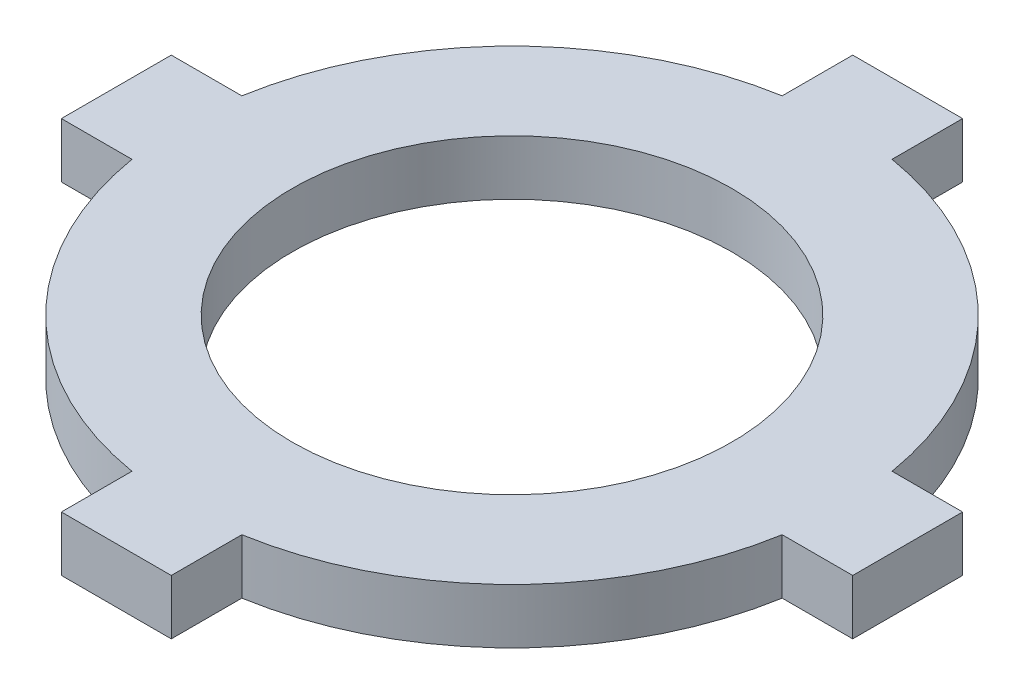
ISO-10303-21;
HEADER;
FILE_DESCRIPTION(('STEP AP214'),'2;1');
FILE_NAME('part.step','',(''),(''),'','','');
FILE_SCHEMA(('AUTOMOTIVE_DESIGN { 1 0 10303 214 1 1 1 1 }'));
ENDSEC;
DATA;
#1=APPLICATION_CONTEXT('core data for automotive mechanical design processes');
#2=APPLICATION_PROTOCOL_DEFINITION('international standard','automotive_design',2000,#1);
#3=PRODUCT_CONTEXT('',#1,'mechanical');
#4=PRODUCT('Part','Part','',(#3));
#5=PRODUCT_RELATED_PRODUCT_CATEGORY('part','',(#4));
#6=PRODUCT_DEFINITION_FORMATION('','',#4);
#7=PRODUCT_DEFINITION_CONTEXT('part definition',#1,'design');
#8=PRODUCT_DEFINITION('design','',#6,#7);
#9=PRODUCT_DEFINITION_SHAPE('','',#8);
#10=(LENGTH_UNIT() NAMED_UNIT(*) SI_UNIT(.MILLI.,.METRE.));
#11=(NAMED_UNIT(*) PLANE_ANGLE_UNIT() SI_UNIT($,.RADIAN.));
#12=(NAMED_UNIT(*) SI_UNIT($,.STERADIAN.) SOLID_ANGLE_UNIT());
#13=UNCERTAINTY_MEASURE_WITH_UNIT(LENGTH_MEASURE(1.E-05),#10,'distance_accuracy_value','');
#14=(GEOMETRIC_REPRESENTATION_CONTEXT(3) GLOBAL_UNCERTAINTY_ASSIGNED_CONTEXT((#13)) GLOBAL_UNIT_ASSIGNED_CONTEXT((#10,
#11,#12)) REPRESENTATION_CONTEXT('',''));
#15=CARTESIAN_POINT('',(0.,0.,0.));
#16=DIRECTION('',(0.,0.,1.));
#17=DIRECTION('',(1.,0.,0.));
#18=AXIS2_PLACEMENT_3D('',#15,#16,#17);
#19=CARTESIAN_POINT('',(0.,3.175,0.));
#20=DIRECTION('',(0.,1.,0.));
#21=DIRECTION('',(0.,0.,1.));
#22=AXIS2_PLACEMENT_3D('',#19,#20,#21);
#23=PLANE('',#22);
#24=CARTESIAN_POINT('',(0.,3.175,0.));
#25=DIRECTION('',(0.,1.,0.));
#26=DIRECTION('',(0.,0.,1.));
#27=AXIS2_PLACEMENT_3D('',#24,#25,#26);
#28=CIRCLE('',#27,19.05);
#29=CARTESIAN_POINT('',(-3.175,3.175,-18.7835533113413));
#30=VERTEX_POINT('',#29);
#31=CARTESIAN_POINT('',(-18.7835533113413,3.175,-3.175));
#32=VERTEX_POINT('',#31);
#33=EDGE_CURVE('E211',#30,#32,#28,.T.);
#34=ORIENTED_EDGE('',*,*,#33,.T.);
#35=DIRECTION('',(-1.,0.,0.));
#36=VECTOR('',#35,1.);
#37=CARTESIAN_POINT('',(-18.7835533113413,3.175,-3.175));
#38=LINE('',#37,#36);
#39=CARTESIAN_POINT('',(-22.86,3.175,-3.175));
#40=VERTEX_POINT('',#39);
#41=EDGE_CURVE('E119',#32,#40,#38,.T.);
#42=ORIENTED_EDGE('',*,*,#41,.T.);
#43=DIRECTION('',(0.,0.,1.));
#44=VECTOR('',#43,1.);
#45=CARTESIAN_POINT('',(-22.86,3.175,3.175));
#46=LINE('',#45,#44);
#47=CARTESIAN_POINT('',(-22.86,3.175,3.175));
#48=VERTEX_POINT('',#47);
#49=EDGE_CURVE('E250',#40,#48,#46,.T.);
#50=ORIENTED_EDGE('',*,*,#49,.T.);
#51=DIRECTION('',(1.,0.,0.));
#52=VECTOR('',#51,1.);
#53=CARTESIAN_POINT('',(-18.7835533113413,3.175,3.175));
#54=LINE('',#53,#52);
#55=CARTESIAN_POINT('',(-18.7835533113413,3.175,3.175));
#56=VERTEX_POINT('',#55);
#57=EDGE_CURVE('E269',#48,#56,#54,.T.);
#58=ORIENTED_EDGE('',*,*,#57,.T.);
#59=CARTESIAN_POINT('',(0.,3.175,0.));
#60=DIRECTION('',(0.,1.,0.));
#61=DIRECTION('',(0.,0.,1.));
#62=AXIS2_PLACEMENT_3D('',#59,#60,#61);
#63=CIRCLE('',#62,19.05);
#64=CARTESIAN_POINT('',(-3.175,3.175,18.7835533113413));
#65=VERTEX_POINT('',#64);
#66=EDGE_CURVE('E266',#56,#65,#63,.T.);
#67=ORIENTED_EDGE('',*,*,#66,.T.);
#68=DIRECTION('',(0.,0.,1.));
#69=VECTOR('',#68,1.);
#70=CARTESIAN_POINT('',(-3.175,3.175,22.86));
#71=LINE('',#70,#69);
#72=CARTESIAN_POINT('',(-3.175,3.175,22.86));
#73=VERTEX_POINT('',#72);
#74=EDGE_CURVE('E268',#65,#73,#71,.T.);
#75=ORIENTED_EDGE('',*,*,#74,.T.);
#76=DIRECTION('',(1.,0.,0.));
#77=VECTOR('',#76,1.);
#78=CARTESIAN_POINT('',(3.175,3.175,22.86));
#79=LINE('',#78,#77);
#80=CARTESIAN_POINT('',(3.175,3.175,22.86));
#81=VERTEX_POINT('',#80);
#82=EDGE_CURVE('E271',#73,#81,#79,.T.);
#83=ORIENTED_EDGE('',*,*,#82,.T.);
#84=DIRECTION('',(0.,0.,-1.));
#85=VECTOR('',#84,1.);
#86=CARTESIAN_POINT('',(3.175,3.175,22.86));
#87=LINE('',#86,#85);
#88=CARTESIAN_POINT('',(3.175,3.175,18.7835533113413));
#89=VERTEX_POINT('',#88);
#90=EDGE_CURVE('E277',#81,#89,#87,.T.);
#91=ORIENTED_EDGE('',*,*,#90,.T.);
#92=CARTESIAN_POINT('',(0.,3.175,0.));
#93=DIRECTION('',(0.,1.,0.));
#94=DIRECTION('',(0.,0.,1.));
#95=AXIS2_PLACEMENT_3D('',#92,#93,#94);
#96=CIRCLE('',#95,19.05);
#97=CARTESIAN_POINT('',(18.7835533113413,3.175,3.175));
#98=VERTEX_POINT('',#97);
#99=EDGE_CURVE('E279',#89,#98,#96,.T.);
#100=ORIENTED_EDGE('',*,*,#99,.T.);
#101=DIRECTION('',(1.,0.,0.));
#102=VECTOR('',#101,1.);
#103=CARTESIAN_POINT('',(22.86,3.175,3.175));
#104=LINE('',#103,#102);
#105=CARTESIAN_POINT('',(22.86,3.175,3.175));
#106=VERTEX_POINT('',#105);
#107=EDGE_CURVE('E281',#98,#106,#104,.T.);
#108=ORIENTED_EDGE('',*,*,#107,.T.);
#109=DIRECTION('',(0.,0.,-1.));
#110=VECTOR('',#109,1.);
#111=CARTESIAN_POINT('',(22.86,3.175,3.175));
#112=LINE('',#111,#110);
#113=CARTESIAN_POINT('',(22.86,3.175,-3.175));
#114=VERTEX_POINT('',#113);
#115=EDGE_CURVE('E283',#106,#114,#112,.T.);
#116=ORIENTED_EDGE('',*,*,#115,.T.);
#117=DIRECTION('',(-1.,0.,0.));
#118=VECTOR('',#117,1.);
#119=CARTESIAN_POINT('',(22.86,3.175,-3.175));
#120=LINE('',#119,#118);
#121=CARTESIAN_POINT('',(18.7835533113413,3.175,-3.175));
#122=VERTEX_POINT('',#121);
#123=EDGE_CURVE('E285',#114,#122,#120,.T.);
#124=ORIENTED_EDGE('',*,*,#123,.T.);
#125=CARTESIAN_POINT('',(0.,3.175,0.));
#126=DIRECTION('',(0.,1.,0.));
#127=DIRECTION('',(0.,0.,1.));
#128=AXIS2_PLACEMENT_3D('',#125,#126,#127);
#129=CIRCLE('',#128,19.05);
#130=CARTESIAN_POINT('',(3.175,3.175,-18.7835533113413));
#131=VERTEX_POINT('',#130);
#132=EDGE_CURVE('E162',#122,#131,#129,.T.);
#133=ORIENTED_EDGE('',*,*,#132,.T.);
#134=DIRECTION('',(0.,0.,-1.));
#135=VECTOR('',#134,1.);
#136=CARTESIAN_POINT('',(3.175,3.175,-18.7835533113413));
#137=LINE('',#136,#135);
#138=CARTESIAN_POINT('',(3.175,3.175,-22.86));
#139=VERTEX_POINT('',#138);
#140=EDGE_CURVE('E156',#131,#139,#137,.T.);
#141=ORIENTED_EDGE('',*,*,#140,.T.);
#142=DIRECTION('',(-1.,0.,0.));
#143=VECTOR('',#142,1.);
#144=CARTESIAN_POINT('',(3.175,3.175,-22.86));
#145=LINE('',#144,#143);
#146=CARTESIAN_POINT('',(-3.175,3.175,-22.86));
#147=VERTEX_POINT('',#146);
#148=EDGE_CURVE('E160',#139,#147,#145,.T.);
#149=ORIENTED_EDGE('',*,*,#148,.T.);
#150=DIRECTION('',(0.,0.,1.));
#151=VECTOR('',#150,1.);
#152=CARTESIAN_POINT('',(-3.175,3.175,-18.7835533113413));
#153=LINE('',#152,#151);
#154=EDGE_CURVE('E52',#147,#30,#153,.T.);
#155=ORIENTED_EDGE('',*,*,#154,.T.);
#156=EDGE_LOOP('',(#34,#42,#50,#58,#67,#75,#83,#91,#100,#108,#116,#124,#133,#141,#149,#155));
#157=FACE_BOUND('',#156,.T.);
#158=CARTESIAN_POINT('',(0.,3.175,0.));
#159=DIRECTION('',(0.,1.,0.));
#160=DIRECTION('',(0.,0.,1.));
#161=AXIS2_PLACEMENT_3D('',#158,#159,#160);
#162=CIRCLE('',#161,12.7);
#163=CARTESIAN_POINT('',(0.,3.175,12.7));
#164=VERTEX_POINT('',#163);
#165=EDGE_CURVE('E184',#164,#164,#162,.T.);
#166=ORIENTED_EDGE('',*,*,#165,.F.);
#167=EDGE_LOOP('',(#166));
#168=FACE_BOUND('',#167,.T.);
#169=ADVANCED_FACE('F35',(#157,#168),#23,.T.);
#170=CARTESIAN_POINT('',(0.,0.,0.));
#171=DIRECTION('',(0.,1.,0.));
#172=DIRECTION('',(0.,0.,1.));
#173=AXIS2_PLACEMENT_3D('',#170,#171,#172);
#174=PLANE('',#173);
#175=CARTESIAN_POINT('',(0.,0.,0.));
#176=DIRECTION('',(0.,1.,0.));
#177=DIRECTION('',(0.,0.,1.));
#178=AXIS2_PLACEMENT_3D('',#175,#176,#177);
#179=CIRCLE('',#178,19.05);
#180=CARTESIAN_POINT('',(-3.175,0.,-18.7835533113413));
#181=VERTEX_POINT('',#180);
#182=CARTESIAN_POINT('',(-18.7835533113413,0.,-3.175));
#183=VERTEX_POINT('',#182);
#184=EDGE_CURVE('E180',#181,#183,#179,.T.);
#185=ORIENTED_EDGE('',*,*,#184,.F.);
#186=DIRECTION('',(0.,0.,1.));
#187=VECTOR('',#186,1.);
#188=CARTESIAN_POINT('',(-3.175,0.,-18.7835533113413));
#189=LINE('',#188,#187);
#190=CARTESIAN_POINT('',(-3.175,0.,-22.86));
#191=VERTEX_POINT('',#190);
#192=EDGE_CURVE('E111',#191,#181,#189,.T.);
#193=ORIENTED_EDGE('',*,*,#192,.F.);
#194=DIRECTION('',(-1.,0.,0.));
#195=VECTOR('',#194,1.);
#196=CARTESIAN_POINT('',(3.175,0.,-22.86));
#197=LINE('',#196,#195);
#198=CARTESIAN_POINT('',(3.175,0.,-22.86));
#199=VERTEX_POINT('',#198);
#200=EDGE_CURVE('E105',#199,#191,#197,.T.);
#201=ORIENTED_EDGE('',*,*,#200,.F.);
#202=DIRECTION('',(0.,0.,-1.));
#203=VECTOR('',#202,1.);
#204=CARTESIAN_POINT('',(3.175,0.,-18.7835533113413));
#205=LINE('',#204,#203);
#206=CARTESIAN_POINT('',(3.175,0.,-18.7835533113413));
#207=VERTEX_POINT('',#206);
#208=EDGE_CURVE('E170',#207,#199,#205,.T.);
#209=ORIENTED_EDGE('',*,*,#208,.F.);
#210=CARTESIAN_POINT('',(0.,0.,0.));
#211=DIRECTION('',(0.,1.,0.));
#212=DIRECTION('',(0.,0.,1.));
#213=AXIS2_PLACEMENT_3D('',#210,#211,#212);
#214=CIRCLE('',#213,19.05);
#215=CARTESIAN_POINT('',(18.7835533113413,0.,-3.175));
#216=VERTEX_POINT('',#215);
#217=EDGE_CURVE('E206',#216,#207,#214,.T.);
#218=ORIENTED_EDGE('',*,*,#217,.F.);
#219=DIRECTION('',(-1.,0.,0.));
#220=VECTOR('',#219,1.);
#221=CARTESIAN_POINT('',(22.86,0.,-3.175));
#222=LINE('',#221,#220);
#223=CARTESIAN_POINT('',(22.86,0.,-3.175));
#224=VERTEX_POINT('',#223);
#225=EDGE_CURVE('E204',#224,#216,#222,.T.);
#226=ORIENTED_EDGE('',*,*,#225,.F.);
#227=DIRECTION('',(0.,0.,-1.));
#228=VECTOR('',#227,1.);
#229=CARTESIAN_POINT('',(22.86,0.,3.175));
#230=LINE('',#229,#228);
#231=CARTESIAN_POINT('',(22.86,0.,3.175));
#232=VERTEX_POINT('',#231);
#233=EDGE_CURVE('E202',#232,#224,#230,.T.);
#234=ORIENTED_EDGE('',*,*,#233,.F.);
#235=DIRECTION('',(1.,0.,0.));
#236=VECTOR('',#235,1.);
#237=CARTESIAN_POINT('',(22.86,0.,3.175));
#238=LINE('',#237,#236);
#239=CARTESIAN_POINT('',(18.7835533113413,0.,3.175));
#240=VERTEX_POINT('',#239);
#241=EDGE_CURVE('E200',#240,#232,#238,.T.);
#242=ORIENTED_EDGE('',*,*,#241,.F.);
#243=CARTESIAN_POINT('',(0.,0.,0.));
#244=DIRECTION('',(0.,1.,0.));
#245=DIRECTION('',(0.,0.,1.));
#246=AXIS2_PLACEMENT_3D('',#243,#244,#245);
#247=CIRCLE('',#246,19.05);
#248=CARTESIAN_POINT('',(3.175,0.,18.7835533113413));
#249=VERTEX_POINT('',#248);
#250=EDGE_CURVE('E198',#249,#240,#247,.T.);
#251=ORIENTED_EDGE('',*,*,#250,.F.);
#252=DIRECTION('',(0.,0.,-1.));
#253=VECTOR('',#252,1.);
#254=CARTESIAN_POINT('',(3.175,0.,22.86));
#255=LINE('',#254,#253);
#256=CARTESIAN_POINT('',(3.175,0.,22.86));
#257=VERTEX_POINT('',#256);
#258=EDGE_CURVE('E196',#257,#249,#255,.T.);
#259=ORIENTED_EDGE('',*,*,#258,.F.);
#260=DIRECTION('',(1.,0.,0.));
#261=VECTOR('',#260,1.);
#262=CARTESIAN_POINT('',(3.175,0.,22.86));
#263=LINE('',#262,#261);
#264=CARTESIAN_POINT('',(-3.175,0.,22.86));
#265=VERTEX_POINT('',#264);
#266=EDGE_CURVE('E194',#265,#257,#263,.T.);
#267=ORIENTED_EDGE('',*,*,#266,.F.);
#268=DIRECTION('',(0.,0.,1.));
#269=VECTOR('',#268,1.);
#270=CARTESIAN_POINT('',(-3.175,0.,22.86));
#271=LINE('',#270,#269);
#272=CARTESIAN_POINT('',(-3.175,0.,18.7835533113413));
#273=VERTEX_POINT('',#272);
#274=EDGE_CURVE('E192',#273,#265,#271,.T.);
#275=ORIENTED_EDGE('',*,*,#274,.F.);
#276=CARTESIAN_POINT('',(0.,0.,0.));
#277=DIRECTION('',(0.,1.,0.));
#278=DIRECTION('',(0.,0.,1.));
#279=AXIS2_PLACEMENT_3D('',#276,#277,#278);
#280=CIRCLE('',#279,19.05);
#281=CARTESIAN_POINT('',(-18.7835533113413,0.,3.175));
#282=VERTEX_POINT('',#281);
#283=EDGE_CURVE('E190',#282,#273,#280,.T.);
#284=ORIENTED_EDGE('',*,*,#283,.F.);
#285=DIRECTION('',(1.,0.,0.));
#286=VECTOR('',#285,1.);
#287=CARTESIAN_POINT('',(-18.7835533113413,0.,3.175));
#288=LINE('',#287,#286);
#289=CARTESIAN_POINT('',(-22.86,0.,3.175));
#290=VERTEX_POINT('',#289);
#291=EDGE_CURVE('E188',#290,#282,#288,.T.);
#292=ORIENTED_EDGE('',*,*,#291,.F.);
#293=DIRECTION('',(0.,0.,1.));
#294=VECTOR('',#293,1.);
#295=CARTESIAN_POINT('',(-22.86,0.,3.175));
#296=LINE('',#295,#294);
#297=CARTESIAN_POINT('',(-22.86,0.,-3.175));
#298=VERTEX_POINT('',#297);
#299=EDGE_CURVE('E186',#298,#290,#296,.T.);
#300=ORIENTED_EDGE('',*,*,#299,.F.);
#301=DIRECTION('',(-1.,0.,0.));
#302=VECTOR('',#301,1.);
#303=CARTESIAN_POINT('',(-18.7835533113413,0.,-3.175));
#304=LINE('',#303,#302);
#305=EDGE_CURVE('E183',#183,#298,#304,.T.);
#306=ORIENTED_EDGE('',*,*,#305,.F.);
#307=EDGE_LOOP('',(#185,#193,#201,#209,#218,#226,#234,#242,#251,#259,#267,#275,#284,#292,#300,#306));
#308=FACE_BOUND('',#307,.T.);
#309=CARTESIAN_POINT('',(0.,0.,0.));
#310=DIRECTION('',(0.,1.,0.));
#311=DIRECTION('',(0.,0.,1.));
#312=AXIS2_PLACEMENT_3D('',#309,#310,#311);
#313=CIRCLE('',#312,12.7);
#314=CARTESIAN_POINT('',(0.,0.,12.7));
#315=VERTEX_POINT('',#314);
#316=EDGE_CURVE('E484',#315,#315,#313,.T.);
#317=ORIENTED_EDGE('',*,*,#316,.T.);
#318=EDGE_LOOP('',(#317));
#319=FACE_BOUND('',#318,.T.);
#320=ADVANCED_FACE('F254',(#308,#319),#174,.F.);
#321=CARTESIAN_POINT('',(0.,3.175,0.));
#322=DIRECTION('',(0.,-1.,0.));
#323=DIRECTION('',(0.,0.,-1.));
#324=AXIS2_PLACEMENT_3D('',#321,#322,#323);
#325=CYLINDRICAL_SURFACE('',#324,19.05);
#326=ORIENTED_EDGE('',*,*,#184,.T.);
#327=DIRECTION('',(0.,-1.,0.));
#328=VECTOR('',#327,1.);
#329=CARTESIAN_POINT('',(-18.7835533113413,3.175,-3.175));
#330=LINE('',#329,#328);
#331=EDGE_CURVE('E11',#32,#183,#330,.T.);
#332=ORIENTED_EDGE('',*,*,#331,.F.);
#333=ORIENTED_EDGE('',*,*,#33,.F.);
#334=DIRECTION('',(0.,-1.,0.));
#335=VECTOR('',#334,1.);
#336=CARTESIAN_POINT('',(-3.175,3.175,-18.7835533113413));
#337=LINE('',#336,#335);
#338=EDGE_CURVE('E176',#30,#181,#337,.T.);
#339=ORIENTED_EDGE('',*,*,#338,.T.);
#340=EDGE_LOOP('',(#326,#332,#333,#339));
#341=FACE_BOUND('',#340,.T.);
#342=ADVANCED_FACE('F37',(#341),#325,.T.);
#343=CARTESIAN_POINT('',(-18.7835533113413,3.175,-3.175));
#344=DIRECTION('',(0.,0.,1.));
#345=DIRECTION('',(1.,0.,0.));
#346=AXIS2_PLACEMENT_3D('',#343,#344,#345);
#347=PLANE('',#346);
#348=ORIENTED_EDGE('',*,*,#305,.T.);
#349=DIRECTION('',(0.,-1.,0.));
#350=VECTOR('',#349,1.);
#351=CARTESIAN_POINT('',(-22.86,3.175,-3.175));
#352=LINE('',#351,#350);
#353=EDGE_CURVE('E44',#40,#298,#352,.T.);
#354=ORIENTED_EDGE('',*,*,#353,.F.);
#355=ORIENTED_EDGE('',*,*,#41,.F.);
#356=ORIENTED_EDGE('',*,*,#331,.T.);
#357=EDGE_LOOP('',(#348,#354,#355,#356));
#358=FACE_BOUND('',#357,.T.);
#359=ADVANCED_FACE('F319',(#358),#347,.F.);
#360=CARTESIAN_POINT('',(-22.86,3.175,3.175));
#361=DIRECTION('',(1.,0.,0.));
#362=DIRECTION('',(0.,0.,-1.));
#363=AXIS2_PLACEMENT_3D('',#360,#361,#362);
#364=PLANE('',#363);
#365=ORIENTED_EDGE('',*,*,#299,.T.);
#366=DIRECTION('',(0.,-1.,0.));
#367=VECTOR('',#366,1.);
#368=CARTESIAN_POINT('',(-22.86,3.175,3.175));
#369=LINE('',#368,#367);
#370=EDGE_CURVE('E242',#48,#290,#369,.T.);
#371=ORIENTED_EDGE('',*,*,#370,.F.);
#372=ORIENTED_EDGE('',*,*,#49,.F.);
#373=ORIENTED_EDGE('',*,*,#353,.T.);
#374=EDGE_LOOP('',(#365,#371,#372,#373));
#375=FACE_BOUND('',#374,.T.);
#376=ADVANCED_FACE('F248',(#375),#364,.F.);
#377=CARTESIAN_POINT('',(-18.7835533113413,3.175,3.175));
#378=DIRECTION('',(0.,0.,-1.));
#379=DIRECTION('',(-1.,0.,0.));
#380=AXIS2_PLACEMENT_3D('',#377,#378,#379);
#381=PLANE('',#380);
#382=ORIENTED_EDGE('',*,*,#291,.T.);
#383=DIRECTION('',(0.,-1.,0.));
#384=VECTOR('',#383,1.);
#385=CARTESIAN_POINT('',(-18.7835533113413,3.175,3.175));
#386=LINE('',#385,#384);
#387=EDGE_CURVE('E239',#56,#282,#386,.T.);
#388=ORIENTED_EDGE('',*,*,#387,.F.);
#389=ORIENTED_EDGE('',*,*,#57,.F.);
#390=ORIENTED_EDGE('',*,*,#370,.T.);
#391=EDGE_LOOP('',(#382,#388,#389,#390));
#392=FACE_BOUND('',#391,.T.);
#393=ADVANCED_FACE('F260',(#392),#381,.F.);
#394=CARTESIAN_POINT('',(0.,3.175,0.));
#395=DIRECTION('',(0.,-1.,0.));
#396=DIRECTION('',(0.,0.,-1.));
#397=AXIS2_PLACEMENT_3D('',#394,#395,#396);
#398=CYLINDRICAL_SURFACE('',#397,19.05);
#399=ORIENTED_EDGE('',*,*,#283,.T.);
#400=DIRECTION('',(0.,-1.,0.));
#401=VECTOR('',#400,1.);
#402=CARTESIAN_POINT('',(-3.175,3.175,18.7835533113413));
#403=LINE('',#402,#401);
#404=EDGE_CURVE('E236',#65,#273,#403,.T.);
#405=ORIENTED_EDGE('',*,*,#404,.F.);
#406=ORIENTED_EDGE('',*,*,#66,.F.);
#407=ORIENTED_EDGE('',*,*,#387,.T.);
#408=EDGE_LOOP('',(#399,#405,#406,#407));
#409=FACE_BOUND('',#408,.T.);
#410=ADVANCED_FACE('F264',(#409),#398,.T.);
#411=CARTESIAN_POINT('',(-3.175,3.175,22.86));
#412=DIRECTION('',(1.,0.,0.));
#413=DIRECTION('',(0.,0.,-1.));
#414=AXIS2_PLACEMENT_3D('',#411,#412,#413);
#415=PLANE('',#414);
#416=ORIENTED_EDGE('',*,*,#274,.T.);
#417=DIRECTION('',(0.,-1.,0.));
#418=VECTOR('',#417,1.);
#419=CARTESIAN_POINT('',(-3.175,3.175,22.86));
#420=LINE('',#419,#418);
#421=EDGE_CURVE('E233',#73,#265,#420,.T.);
#422=ORIENTED_EDGE('',*,*,#421,.F.);
#423=ORIENTED_EDGE('',*,*,#74,.F.);
#424=ORIENTED_EDGE('',*,*,#404,.T.);
#425=EDGE_LOOP('',(#416,#422,#423,#424));
#426=FACE_BOUND('',#425,.T.);
#427=ADVANCED_FACE('F332',(#426),#415,.F.);
#428=CARTESIAN_POINT('',(3.175,3.175,22.86));
#429=DIRECTION('',(0.,0.,-1.));
#430=DIRECTION('',(-1.,0.,0.));
#431=AXIS2_PLACEMENT_3D('',#428,#429,#430);
#432=PLANE('',#431);
#433=ORIENTED_EDGE('',*,*,#266,.T.);
#434=DIRECTION('',(0.,-1.,0.));
#435=VECTOR('',#434,1.);
#436=CARTESIAN_POINT('',(3.175,3.175,22.86));
#437=LINE('',#436,#435);
#438=EDGE_CURVE('E230',#81,#257,#437,.T.);
#439=ORIENTED_EDGE('',*,*,#438,.F.);
#440=ORIENTED_EDGE('',*,*,#82,.F.);
#441=ORIENTED_EDGE('',*,*,#421,.T.);
#442=EDGE_LOOP('',(#433,#439,#440,#441));
#443=FACE_BOUND('',#442,.T.);
#444=ADVANCED_FACE('F335',(#443),#432,.F.);
#445=CARTESIAN_POINT('',(3.175,3.175,22.86));
#446=DIRECTION('',(-1.,0.,0.));
#447=DIRECTION('',(0.,0.,1.));
#448=AXIS2_PLACEMENT_3D('',#445,#446,#447);
#449=PLANE('',#448);
#450=ORIENTED_EDGE('',*,*,#258,.T.);
#451=DIRECTION('',(0.,-1.,0.));
#452=VECTOR('',#451,1.);
#453=CARTESIAN_POINT('',(3.175,3.175,18.7835533113413));
#454=LINE('',#453,#452);
#455=EDGE_CURVE('E227',#89,#249,#454,.T.);
#456=ORIENTED_EDGE('',*,*,#455,.F.);
#457=ORIENTED_EDGE('',*,*,#90,.F.);
#458=ORIENTED_EDGE('',*,*,#438,.T.);
#459=EDGE_LOOP('',(#450,#456,#457,#458));
#460=FACE_BOUND('',#459,.T.);
#461=ADVANCED_FACE('F339',(#460),#449,.F.);
#462=CARTESIAN_POINT('',(0.,3.175,0.));
#463=DIRECTION('',(0.,-1.,0.));
#464=DIRECTION('',(0.,0.,-1.));
#465=AXIS2_PLACEMENT_3D('',#462,#463,#464);
#466=CYLINDRICAL_SURFACE('',#465,19.05);
#467=ORIENTED_EDGE('',*,*,#250,.T.);
#468=DIRECTION('',(0.,-1.,0.));
#469=VECTOR('',#468,1.);
#470=CARTESIAN_POINT('',(18.7835533113413,3.175,3.175));
#471=LINE('',#470,#469);
#472=EDGE_CURVE('E224',#98,#240,#471,.T.);
#473=ORIENTED_EDGE('',*,*,#472,.F.);
#474=ORIENTED_EDGE('',*,*,#99,.F.);
#475=ORIENTED_EDGE('',*,*,#455,.T.);
#476=EDGE_LOOP('',(#467,#473,#474,#475));
#477=FACE_BOUND('',#476,.T.);
#478=ADVANCED_FACE('F343',(#477),#466,.T.);
#479=CARTESIAN_POINT('',(22.86,3.175,3.175));
#480=DIRECTION('',(0.,0.,-1.));
#481=DIRECTION('',(-1.,0.,0.));
#482=AXIS2_PLACEMENT_3D('',#479,#480,#481);
#483=PLANE('',#482);
#484=ORIENTED_EDGE('',*,*,#241,.T.);
#485=DIRECTION('',(0.,-1.,0.));
#486=VECTOR('',#485,1.);
#487=CARTESIAN_POINT('',(22.86,3.175,3.175));
#488=LINE('',#487,#486);
#489=EDGE_CURVE('E221',#106,#232,#488,.T.);
#490=ORIENTED_EDGE('',*,*,#489,.F.);
#491=ORIENTED_EDGE('',*,*,#107,.F.);
#492=ORIENTED_EDGE('',*,*,#472,.T.);
#493=EDGE_LOOP('',(#484,#490,#491,#492));
#494=FACE_BOUND('',#493,.T.);
#495=ADVANCED_FACE('F347',(#494),#483,.F.);
#496=CARTESIAN_POINT('',(22.86,3.175,3.175));
#497=DIRECTION('',(-1.,0.,0.));
#498=DIRECTION('',(0.,0.,1.));
#499=AXIS2_PLACEMENT_3D('',#496,#497,#498);
#500=PLANE('',#499);
#501=ORIENTED_EDGE('',*,*,#233,.T.);
#502=DIRECTION('',(0.,-1.,0.));
#503=VECTOR('',#502,1.);
#504=CARTESIAN_POINT('',(22.86,3.175,-3.175));
#505=LINE('',#504,#503);
#506=EDGE_CURVE('E218',#114,#224,#505,.T.);
#507=ORIENTED_EDGE('',*,*,#506,.F.);
#508=ORIENTED_EDGE('',*,*,#115,.F.);
#509=ORIENTED_EDGE('',*,*,#489,.T.);
#510=EDGE_LOOP('',(#501,#507,#508,#509));
#511=FACE_BOUND('',#510,.T.);
#512=ADVANCED_FACE('F351',(#511),#500,.F.);
#513=CARTESIAN_POINT('',(22.86,3.175,-3.175));
#514=DIRECTION('',(0.,0.,1.));
#515=DIRECTION('',(1.,0.,0.));
#516=AXIS2_PLACEMENT_3D('',#513,#514,#515);
#517=PLANE('',#516);
#518=ORIENTED_EDGE('',*,*,#225,.T.);
#519=DIRECTION('',(0.,-1.,0.));
#520=VECTOR('',#519,1.);
#521=CARTESIAN_POINT('',(18.7835533113413,3.175,-3.175));
#522=LINE('',#521,#520);
#523=EDGE_CURVE('E215',#122,#216,#522,.T.);
#524=ORIENTED_EDGE('',*,*,#523,.F.);
#525=ORIENTED_EDGE('',*,*,#123,.F.);
#526=ORIENTED_EDGE('',*,*,#506,.T.);
#527=EDGE_LOOP('',(#518,#524,#525,#526));
#528=FACE_BOUND('',#527,.T.);
#529=ADVANCED_FACE('F291',(#528),#517,.F.);
#530=CARTESIAN_POINT('',(0.,3.175,0.));
#531=DIRECTION('',(0.,-1.,0.));
#532=DIRECTION('',(0.,0.,-1.));
#533=AXIS2_PLACEMENT_3D('',#530,#531,#532);
#534=CYLINDRICAL_SURFACE('',#533,19.05);
#535=ORIENTED_EDGE('',*,*,#217,.T.);
#536=DIRECTION('',(0.,-1.,0.));
#537=VECTOR('',#536,1.);
#538=CARTESIAN_POINT('',(3.175,3.175,-18.7835533113413));
#539=LINE('',#538,#537);
#540=EDGE_CURVE('E171',#131,#207,#539,.T.);
#541=ORIENTED_EDGE('',*,*,#540,.F.);
#542=ORIENTED_EDGE('',*,*,#132,.F.);
#543=ORIENTED_EDGE('',*,*,#523,.T.);
#544=EDGE_LOOP('',(#535,#541,#542,#543));
#545=FACE_BOUND('',#544,.T.);
#546=ADVANCED_FACE('F295',(#545),#534,.T.);
#547=CARTESIAN_POINT('',(3.175,3.175,-18.7835533113413));
#548=DIRECTION('',(-1.,0.,0.));
#549=DIRECTION('',(0.,0.,1.));
#550=AXIS2_PLACEMENT_3D('',#547,#548,#549);
#551=PLANE('',#550);
#552=ORIENTED_EDGE('',*,*,#208,.T.);
#553=DIRECTION('',(0.,-1.,0.));
#554=VECTOR('',#553,1.);
#555=CARTESIAN_POINT('',(3.175,3.175,-22.86));
#556=LINE('',#555,#554);
#557=EDGE_CURVE('E167',#139,#199,#556,.T.);
#558=ORIENTED_EDGE('',*,*,#557,.F.);
#559=ORIENTED_EDGE('',*,*,#140,.F.);
#560=ORIENTED_EDGE('',*,*,#540,.T.);
#561=EDGE_LOOP('',(#552,#558,#559,#560));
#562=FACE_BOUND('',#561,.T.);
#563=ADVANCED_FACE('F168',(#562),#551,.F.);
#564=CARTESIAN_POINT('',(3.175,3.175,-22.86));
#565=DIRECTION('',(0.,0.,1.));
#566=DIRECTION('',(1.,0.,0.));
#567=AXIS2_PLACEMENT_3D('',#564,#565,#566);
#568=PLANE('',#567);
#569=ORIENTED_EDGE('',*,*,#200,.T.);
#570=DIRECTION('',(0.,-1.,0.));
#571=VECTOR('',#570,1.);
#572=CARTESIAN_POINT('',(-3.175,3.175,-22.86));
#573=LINE('',#572,#571);
#574=EDGE_CURVE('E172',#147,#191,#573,.T.);
#575=ORIENTED_EDGE('',*,*,#574,.F.);
#576=ORIENTED_EDGE('',*,*,#148,.F.);
#577=ORIENTED_EDGE('',*,*,#557,.T.);
#578=EDGE_LOOP('',(#569,#575,#576,#577));
#579=FACE_BOUND('',#578,.T.);
#580=ADVANCED_FACE('F174',(#579),#568,.F.);
#581=CARTESIAN_POINT('',(-3.175,3.175,-18.7835533113413));
#582=DIRECTION('',(1.,0.,0.));
#583=DIRECTION('',(0.,0.,-1.));
#584=AXIS2_PLACEMENT_3D('',#581,#582,#583);
#585=PLANE('',#584);
#586=ORIENTED_EDGE('',*,*,#192,.T.);
#587=ORIENTED_EDGE('',*,*,#338,.F.);
#588=ORIENTED_EDGE('',*,*,#154,.F.);
#589=ORIENTED_EDGE('',*,*,#574,.T.);
#590=EDGE_LOOP('',(#586,#587,#588,#589));
#591=FACE_BOUND('',#590,.T.);
#592=ADVANCED_FACE('F299',(#591),#585,.F.);
#593=CARTESIAN_POINT('',(0.,3.175,0.));
#594=DIRECTION('',(0.,-1.,0.));
#595=DIRECTION('',(0.,0.,-1.));
#596=AXIS2_PLACEMENT_3D('',#593,#594,#595);
#597=CYLINDRICAL_SURFACE('',#596,12.7);
#598=ORIENTED_EDGE('',*,*,#165,.T.);
#599=EDGE_LOOP('',(#598));
#600=FACE_BOUND('',#599,.T.);
#601=ORIENTED_EDGE('',*,*,#316,.F.);
#602=EDGE_LOOP('',(#601));
#603=FACE_BOUND('',#602,.T.);
#604=ADVANCED_FACE('F301',(#600,#603),#597,.F.);
#605=CLOSED_SHELL('',(#169,#320,#342,#359,#376,#393,#410,#427,#444,#461,#478,#495,#512,#529,
#546,#563,#580,#592,#604));
#606=MANIFOLD_SOLID_BREP('B2',#605);
#607=ADVANCED_BREP_SHAPE_REPRESENTATION('',(#18,#606),#14);
#608=SHAPE_DEFINITION_REPRESENTATION(#9,#607);
ENDSEC;
END-ISO-10303-21;
